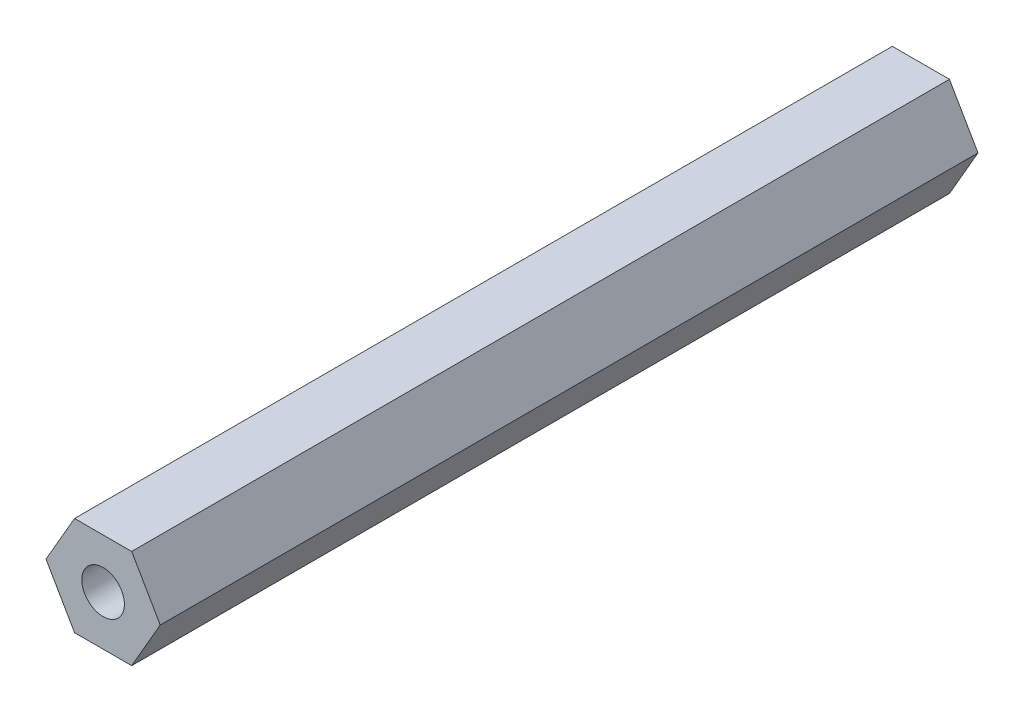
ISO-10303-21;
HEADER;
FILE_DESCRIPTION(('STEP AP214'),'2;1');
FILE_NAME('part.step','',(''),(''),'','','');
FILE_SCHEMA(('AUTOMOTIVE_DESIGN { 1 0 10303 214 1 1 1 1 }'));
ENDSEC;
DATA;
#1=APPLICATION_CONTEXT('core data for automotive mechanical design processes');
#2=APPLICATION_PROTOCOL_DEFINITION('international standard','automotive_design',2000,#1);
#3=PRODUCT_CONTEXT('',#1,'mechanical');
#4=PRODUCT('Part','Part','',(#3));
#5=PRODUCT_RELATED_PRODUCT_CATEGORY('part','',(#4));
#6=PRODUCT_DEFINITION_FORMATION('','',#4);
#7=PRODUCT_DEFINITION_CONTEXT('part definition',#1,'design');
#8=PRODUCT_DEFINITION('design','',#6,#7);
#9=PRODUCT_DEFINITION_SHAPE('','',#8);
#10=(LENGTH_UNIT() NAMED_UNIT(*) SI_UNIT(.MILLI.,.METRE.));
#11=(NAMED_UNIT(*) PLANE_ANGLE_UNIT() SI_UNIT($,.RADIAN.));
#12=(NAMED_UNIT(*) SI_UNIT($,.STERADIAN.) SOLID_ANGLE_UNIT());
#13=UNCERTAINTY_MEASURE_WITH_UNIT(LENGTH_MEASURE(1.E-05),#10,'distance_accuracy_value','');
#14=(GEOMETRIC_REPRESENTATION_CONTEXT(3) GLOBAL_UNCERTAINTY_ASSIGNED_CONTEXT((#13)) GLOBAL_UNIT_ASSIGNED_CONTEXT((#10,
#11,#12)) REPRESENTATION_CONTEXT('',''));
#15=CARTESIAN_POINT('',(0.,0.,0.));
#16=DIRECTION('',(0.,0.,1.));
#17=DIRECTION('',(1.,0.,0.));
#18=AXIS2_PLACEMENT_3D('',#15,#16,#17);
#19=CARTESIAN_POINT('',(2.28053356329901,3.95000000000001,65.3));
#20=DIRECTION('',(0.,-1.,0.));
#21=DIRECTION('',(1.,0.,0.));
#22=AXIS2_PLACEMENT_3D('',#19,#20,#21);
#23=PLANE('',#22);
#24=DIRECTION('',(-1.,0.,0.));
#25=VECTOR('',#24,1.);
#26=CARTESIAN_POINT('',(2.28053356329901,3.95000000000001,0.));
#27=LINE('',#26,#25);
#28=CARTESIAN_POINT('',(2.28053356329901,3.95000000000001,0.));
#29=VERTEX_POINT('',#28);
#30=CARTESIAN_POINT('',(-2.28053356329904,3.94999999999999,0.));
#31=VERTEX_POINT('',#30);
#32=EDGE_CURVE('E116',#29,#31,#27,.T.);
#33=ORIENTED_EDGE('',*,*,#32,.T.);
#34=DIRECTION('',(0.,0.,-1.));
#35=VECTOR('',#34,1.);
#36=CARTESIAN_POINT('',(-2.28053356329904,3.94999999999999,65.3));
#37=LINE('',#36,#35);
#38=CARTESIAN_POINT('',(-2.28053356329904,3.94999999999999,65.3));
#39=VERTEX_POINT('',#38);
#40=EDGE_CURVE('E11',#39,#31,#37,.T.);
#41=ORIENTED_EDGE('',*,*,#40,.F.);
#42=DIRECTION('',(-1.,0.,0.));
#43=VECTOR('',#42,1.);
#44=CARTESIAN_POINT('',(2.28053356329901,3.95000000000001,65.3));
#45=LINE('',#44,#43);
#46=CARTESIAN_POINT('',(2.28053356329901,3.95000000000001,65.3));
#47=VERTEX_POINT('',#46);
#48=EDGE_CURVE('E127',#47,#39,#45,.T.);
#49=ORIENTED_EDGE('',*,*,#48,.F.);
#50=DIRECTION('',(0.,0.,-1.));
#51=VECTOR('',#50,1.);
#52=CARTESIAN_POINT('',(2.28053356329901,3.95000000000001,65.3));
#53=LINE('',#52,#51);
#54=EDGE_CURVE('E112',#47,#29,#53,.T.);
#55=ORIENTED_EDGE('',*,*,#54,.T.);
#56=EDGE_LOOP('',(#33,#41,#49,#55));
#57=FACE_BOUND('',#56,.T.);
#58=ADVANCED_FACE('F32',(#57),#23,.F.);
#59=CARTESIAN_POINT('',(-2.28053356329904,3.94999999999999,65.3));
#60=DIRECTION('',(0.866025403784442,-0.499999999999995,0.));
#61=DIRECTION('',(0.499999999999995,0.866025403784442,0.));
#62=AXIS2_PLACEMENT_3D('',#59,#60,#61);
#63=PLANE('',#62);
#64=DIRECTION('',(-0.499999999999995,-0.866025403784441,0.));
#65=VECTOR('',#64,1.);
#66=CARTESIAN_POINT('',(-2.28053356329904,3.94999999999999,0.));
#67=LINE('',#66,#65);
#68=CARTESIAN_POINT('',(-4.56106712659805,0.,0.));
#69=VERTEX_POINT('',#68);
#70=EDGE_CURVE('E119',#31,#69,#67,.T.);
#71=ORIENTED_EDGE('',*,*,#70,.T.);
#72=DIRECTION('',(0.,0.,-1.));
#73=VECTOR('',#72,1.);
#74=CARTESIAN_POINT('',(-4.56106712659805,0.,65.3));
#75=LINE('',#74,#73);
#76=CARTESIAN_POINT('',(-4.56106712659805,0.,65.3));
#77=VERTEX_POINT('',#76);
#78=EDGE_CURVE('E40',#77,#69,#75,.T.);
#79=ORIENTED_EDGE('',*,*,#78,.F.);
#80=DIRECTION('',(-0.499999999999995,-0.866025403784441,0.));
#81=VECTOR('',#80,1.);
#82=CARTESIAN_POINT('',(-2.28053356329904,3.94999999999999,65.3));
#83=LINE('',#82,#81);
#84=EDGE_CURVE('E85',#39,#77,#83,.T.);
#85=ORIENTED_EDGE('',*,*,#84,.F.);
#86=ORIENTED_EDGE('',*,*,#40,.T.);
#87=EDGE_LOOP('',(#71,#79,#85,#86));
#88=FACE_BOUND('',#87,.T.);
#89=ADVANCED_FACE('F152',(#88),#63,.F.);
#90=CARTESIAN_POINT('',(-4.56106712659805,0.,65.3));
#91=DIRECTION('',(0.866025403784435,0.500000000000007,0.));
#92=DIRECTION('',(-0.500000000000007,0.866025403784435,0.));
#93=AXIS2_PLACEMENT_3D('',#90,#91,#92);
#94=PLANE('',#93);
#95=DIRECTION('',(0.500000000000007,-0.866025403784434,0.));
#96=VECTOR('',#95,1.);
#97=CARTESIAN_POINT('',(-4.56106712659805,0.,0.));
#98=LINE('',#97,#96);
#99=CARTESIAN_POINT('',(-2.28053356329899,-3.95000000000002,0.));
#100=VERTEX_POINT('',#99);
#101=EDGE_CURVE('E122',#69,#100,#98,.T.);
#102=ORIENTED_EDGE('',*,*,#101,.T.);
#103=DIRECTION('',(0.,0.,-1.));
#104=VECTOR('',#103,1.);
#105=CARTESIAN_POINT('',(-2.28053356329899,-3.95000000000002,65.3));
#106=LINE('',#105,#104);
#107=CARTESIAN_POINT('',(-2.28053356329899,-3.95000000000002,65.3));
#108=VERTEX_POINT('',#107);
#109=EDGE_CURVE('E107',#108,#100,#106,.T.);
#110=ORIENTED_EDGE('',*,*,#109,.F.);
#111=DIRECTION('',(0.500000000000007,-0.866025403784434,0.));
#112=VECTOR('',#111,1.);
#113=CARTESIAN_POINT('',(-4.56106712659805,0.,65.3));
#114=LINE('',#113,#112);
#115=EDGE_CURVE('E98',#77,#108,#114,.T.);
#116=ORIENTED_EDGE('',*,*,#115,.F.);
#117=ORIENTED_EDGE('',*,*,#78,.T.);
#118=EDGE_LOOP('',(#102,#110,#116,#117));
#119=FACE_BOUND('',#118,.T.);
#120=ADVANCED_FACE('F133',(#119),#94,.F.);
#121=CARTESIAN_POINT('',(-2.28053356329899,-3.95000000000002,65.3));
#122=DIRECTION('',(0.,1.,0.));
#123=DIRECTION('',(-1.,0.,0.));
#124=AXIS2_PLACEMENT_3D('',#121,#122,#123);
#125=PLANE('',#124);
#126=DIRECTION('',(1.,0.,0.));
#127=VECTOR('',#126,1.);
#128=CARTESIAN_POINT('',(-2.28053356329899,-3.95000000000002,0.));
#129=LINE('',#128,#127);
#130=CARTESIAN_POINT('',(2.28053356329907,-3.94999999999998,0.));
#131=VERTEX_POINT('',#130);
#132=EDGE_CURVE('E106',#100,#131,#129,.T.);
#133=ORIENTED_EDGE('',*,*,#132,.T.);
#134=DIRECTION('',(0.,0.,-1.));
#135=VECTOR('',#134,1.);
#136=CARTESIAN_POINT('',(2.28053356329907,-3.94999999999998,65.3));
#137=LINE('',#136,#135);
#138=CARTESIAN_POINT('',(2.28053356329907,-3.94999999999998,65.3));
#139=VERTEX_POINT('',#138);
#140=EDGE_CURVE('E103',#139,#131,#137,.T.);
#141=ORIENTED_EDGE('',*,*,#140,.F.);
#142=DIRECTION('',(1.,0.,0.));
#143=VECTOR('',#142,1.);
#144=CARTESIAN_POINT('',(-2.28053356329899,-3.95000000000002,65.3));
#145=LINE('',#144,#143);
#146=EDGE_CURVE('E92',#108,#139,#145,.T.);
#147=ORIENTED_EDGE('',*,*,#146,.F.);
#148=ORIENTED_EDGE('',*,*,#109,.T.);
#149=EDGE_LOOP('',(#133,#141,#147,#148));
#150=FACE_BOUND('',#149,.T.);
#151=ADVANCED_FACE('F104',(#150),#125,.F.);
#152=CARTESIAN_POINT('',(2.28053356329907,-3.94999999999998,65.3));
#153=DIRECTION('',(-0.866025403784441,0.499999999999995,0.));
#154=DIRECTION('',(-0.499999999999995,-0.866025403784442,0.));
#155=AXIS2_PLACEMENT_3D('',#152,#153,#154);
#156=PLANE('',#155);
#157=DIRECTION('',(0.499999999999995,0.866025403784442,0.));
#158=VECTOR('',#157,1.);
#159=CARTESIAN_POINT('',(2.28053356329907,-3.94999999999998,0.));
#160=LINE('',#159,#158);
#161=CARTESIAN_POINT('',(4.56106712659805,0.,0.));
#162=VERTEX_POINT('',#161);
#163=EDGE_CURVE('E71',#131,#162,#160,.T.);
#164=ORIENTED_EDGE('',*,*,#163,.T.);
#165=DIRECTION('',(0.,0.,-1.));
#166=VECTOR('',#165,1.);
#167=CARTESIAN_POINT('',(4.56106712659805,0.,65.3));
#168=LINE('',#167,#166);
#169=CARTESIAN_POINT('',(4.56106712659805,0.,65.3));
#170=VERTEX_POINT('',#169);
#171=EDGE_CURVE('E108',#170,#162,#168,.T.);
#172=ORIENTED_EDGE('',*,*,#171,.F.);
#173=DIRECTION('',(0.499999999999995,0.866025403784442,0.));
#174=VECTOR('',#173,1.);
#175=CARTESIAN_POINT('',(2.28053356329907,-3.94999999999998,65.3));
#176=LINE('',#175,#174);
#177=EDGE_CURVE('E96',#139,#170,#176,.T.);
#178=ORIENTED_EDGE('',*,*,#177,.F.);
#179=ORIENTED_EDGE('',*,*,#140,.T.);
#180=EDGE_LOOP('',(#164,#172,#178,#179));
#181=FACE_BOUND('',#180,.T.);
#182=ADVANCED_FACE('F110',(#181),#156,.F.);
#183=CARTESIAN_POINT('',(4.56106712659805,0.,65.3));
#184=DIRECTION('',(-0.866025403784438,-0.500000000000001,0.));
#185=DIRECTION('',(0.500000000000001,-0.866025403784438,0.));
#186=AXIS2_PLACEMENT_3D('',#183,#184,#185);
#187=PLANE('',#186);
#188=DIRECTION('',(-0.500000000000001,0.866025403784438,0.));
#189=VECTOR('',#188,1.);
#190=CARTESIAN_POINT('',(4.56106712659805,0.,0.));
#191=LINE('',#190,#189);
#192=EDGE_CURVE('E77',#162,#29,#191,.T.);
#193=ORIENTED_EDGE('',*,*,#192,.T.);
#194=ORIENTED_EDGE('',*,*,#54,.F.);
#195=DIRECTION('',(-0.500000000000001,0.866025403784438,0.));
#196=VECTOR('',#195,1.);
#197=CARTESIAN_POINT('',(4.56106712659805,0.,65.3));
#198=LINE('',#197,#196);
#199=EDGE_CURVE('E48',#170,#47,#198,.T.);
#200=ORIENTED_EDGE('',*,*,#199,.F.);
#201=ORIENTED_EDGE('',*,*,#171,.T.);
#202=EDGE_LOOP('',(#193,#194,#200,#201));
#203=FACE_BOUND('',#202,.T.);
#204=ADVANCED_FACE('F140',(#203),#187,.F.);
#205=CARTESIAN_POINT('',(0.,0.,65.3));
#206=DIRECTION('',(0.,0.,1.));
#207=DIRECTION('',(1.,0.,0.));
#208=AXIS2_PLACEMENT_3D('',#205,#206,#207);
#209=PLANE('',#208);
#210=CARTESIAN_POINT('',(0.,0.,65.3));
#211=DIRECTION('',(0.,0.,1.));
#212=DIRECTION('',(1.,0.,0.));
#213=AXIS2_PLACEMENT_3D('',#210,#211,#212);
#214=CIRCLE('',#213,1.7);
#215=CARTESIAN_POINT('',(1.7,0.,65.3));
#216=VERTEX_POINT('',#215);
#217=EDGE_CURVE('E207',#216,#216,#214,.T.);
#218=ORIENTED_EDGE('',*,*,#217,.F.);
#219=EDGE_LOOP('',(#218));
#220=FACE_BOUND('',#219,.T.);
#221=ORIENTED_EDGE('',*,*,#48,.T.);
#222=ORIENTED_EDGE('',*,*,#84,.T.);
#223=ORIENTED_EDGE('',*,*,#115,.T.);
#224=ORIENTED_EDGE('',*,*,#146,.T.);
#225=ORIENTED_EDGE('',*,*,#177,.T.);
#226=ORIENTED_EDGE('',*,*,#199,.T.);
#227=EDGE_LOOP('',(#221,#222,#223,#224,#225,#226));
#228=FACE_BOUND('',#227,.T.);
#229=ADVANCED_FACE('F94',(#220,#228),#209,.T.);
#230=CARTESIAN_POINT('',(0.,0.,0.));
#231=DIRECTION('',(0.,0.,1.));
#232=DIRECTION('',(1.,0.,0.));
#233=AXIS2_PLACEMENT_3D('',#230,#231,#232);
#234=PLANE('',#233);
#235=CARTESIAN_POINT('',(0.,0.,0.));
#236=DIRECTION('',(0.,0.,1.));
#237=DIRECTION('',(1.,0.,0.));
#238=AXIS2_PLACEMENT_3D('',#235,#236,#237);
#239=CIRCLE('',#238,1.7);
#240=CARTESIAN_POINT('',(1.7,0.,0.));
#241=VERTEX_POINT('',#240);
#242=EDGE_CURVE('E120',#241,#241,#239,.T.);
#243=ORIENTED_EDGE('',*,*,#242,.T.);
#244=EDGE_LOOP('',(#243));
#245=FACE_BOUND('',#244,.T.);
#246=ORIENTED_EDGE('',*,*,#32,.F.);
#247=ORIENTED_EDGE('',*,*,#192,.F.);
#248=ORIENTED_EDGE('',*,*,#163,.F.);
#249=ORIENTED_EDGE('',*,*,#132,.F.);
#250=ORIENTED_EDGE('',*,*,#101,.F.);
#251=ORIENTED_EDGE('',*,*,#70,.F.);
#252=EDGE_LOOP('',(#246,#247,#248,#249,#250,#251));
#253=FACE_BOUND('',#252,.T.);
#254=ADVANCED_FACE('F136',(#245,#253),#234,.F.);
#255=CARTESIAN_POINT('',(0.,0.,0.));
#256=DIRECTION('',(0.,0.,1.));
#257=DIRECTION('',(1.,0.,0.));
#258=AXIS2_PLACEMENT_3D('',#255,#256,#257);
#259=CYLINDRICAL_SURFACE('',#258,1.7);
#260=ORIENTED_EDGE('',*,*,#242,.F.);
#261=EDGE_LOOP('',(#260));
#262=FACE_BOUND('',#261,.T.);
#263=ORIENTED_EDGE('',*,*,#217,.T.);
#264=EDGE_LOOP('',(#263));
#265=FACE_BOUND('',#264,.T.);
#266=ADVANCED_FACE('F189',(#262,#265),#259,.F.);
#267=CLOSED_SHELL('',(#58,#89,#120,#151,#182,#204,#229,#254,#266));
#268=MANIFOLD_SOLID_BREP('B2',#267);
#269=ADVANCED_BREP_SHAPE_REPRESENTATION('',(#18,#268),#14);
#270=SHAPE_DEFINITION_REPRESENTATION(#9,#269);
ENDSEC;
END-ISO-10303-21;
